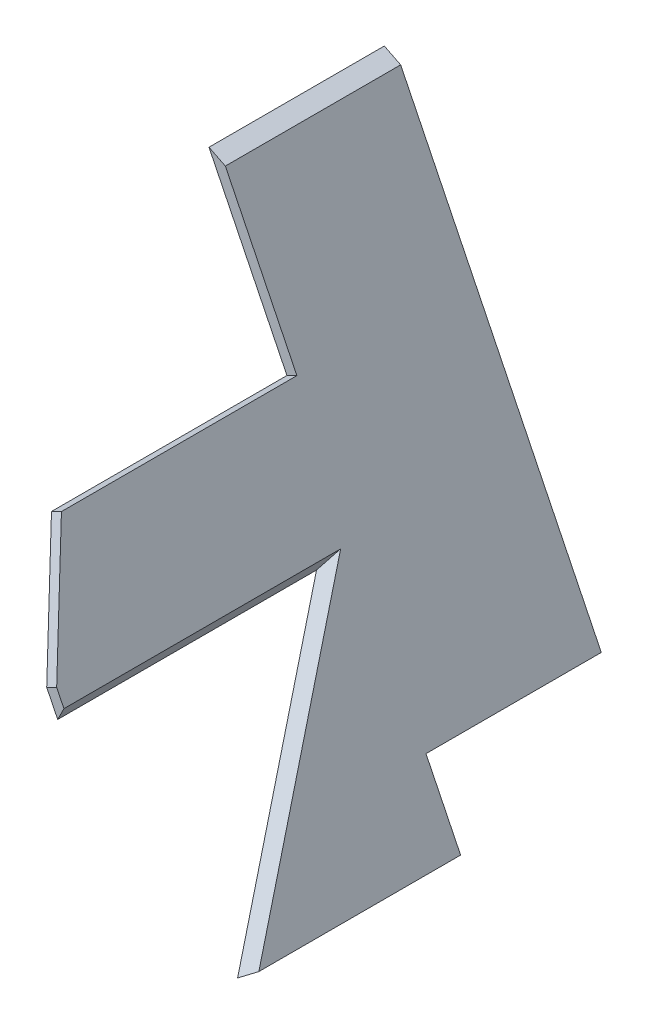
ISO-10303-21;
HEADER;
FILE_DESCRIPTION(('STEP AP214'),'2;1');
FILE_NAME('part.step','',(''),(''),'','','');
FILE_SCHEMA(('AUTOMOTIVE_DESIGN { 1 0 10303 214 1 1 1 1 }'));
ENDSEC;
DATA;
#1=APPLICATION_CONTEXT('core data for automotive mechanical design processes');
#2=APPLICATION_PROTOCOL_DEFINITION('international standard','automotive_design',2000,#1);
#3=PRODUCT_CONTEXT('',#1,'mechanical');
#4=PRODUCT('Part','Part','',(#3));
#5=PRODUCT_RELATED_PRODUCT_CATEGORY('part','',(#4));
#6=PRODUCT_DEFINITION_FORMATION('','',#4);
#7=PRODUCT_DEFINITION_CONTEXT('part definition',#1,'design');
#8=PRODUCT_DEFINITION('design','',#6,#7);
#9=PRODUCT_DEFINITION_SHAPE('','',#8);
#10=(LENGTH_UNIT() NAMED_UNIT(*) SI_UNIT(.MILLI.,.METRE.));
#11=(NAMED_UNIT(*) PLANE_ANGLE_UNIT() SI_UNIT($,.RADIAN.));
#12=(NAMED_UNIT(*) SI_UNIT($,.STERADIAN.) SOLID_ANGLE_UNIT());
#13=UNCERTAINTY_MEASURE_WITH_UNIT(LENGTH_MEASURE(1.E-05),#10,'distance_accuracy_value','');
#14=(GEOMETRIC_REPRESENTATION_CONTEXT(3) GLOBAL_UNCERTAINTY_ASSIGNED_CONTEXT((#13)) GLOBAL_UNIT_ASSIGNED_CONTEXT((#10,
#11,#12)) REPRESENTATION_CONTEXT('',''));
#15=CARTESIAN_POINT('',(0.,0.,0.));
#16=DIRECTION('',(0.,0.,1.));
#17=DIRECTION('',(1.,0.,0.));
#18=AXIS2_PLACEMENT_3D('',#15,#16,#17);
#19=CARTESIAN_POINT('',(-552.096326617514,302.49729542093,598.58590462317));
#20=DIRECTION('',(-0.440786583584168,0.897611936045971,0.));
#21=DIRECTION('',(-0.897611936045971,-0.440786583584168,0.));
#22=AXIS2_PLACEMENT_3D('',#19,#20,#21);
#23=PLANE('',#22);
#24=DIRECTION('',(0.629407485757153,0.309080532675746,-0.712962440240533));
#25=VECTOR('',#24,1.);
#26=CARTESIAN_POINT('',(-717.79653583628,221.127578522489,417.029710060112));
#27=LINE('',#26,#25);
#28=CARTESIAN_POINT('',(-552.096326617514,302.49729542093,229.332505647517));
#29=VERTEX_POINT('',#28);
#30=CARTESIAN_POINT('',(-547.608266937284,304.701228338851,224.248648124416));
#31=VERTEX_POINT('',#30);
#32=EDGE_CURVE('E182',#29,#31,#27,.T.);
#33=ORIENTED_EDGE('',*,*,#32,.F.);
#34=DIRECTION('',(0.,0.,-1.));
#35=VECTOR('',#34,1.);
#36=CARTESIAN_POINT('',(-552.096326617514,302.49729542093,598.58590462317));
#37=LINE('',#36,#35);
#38=CARTESIAN_POINT('',(-552.096326617514,302.49729542093,133.323635178291));
#39=VERTEX_POINT('',#38);
#40=EDGE_CURVE('E194',#29,#39,#37,.T.);
#41=ORIENTED_EDGE('',*,*,#40,.T.);
#42=DIRECTION('',(0.897611936045971,0.440786583584168,0.));
#43=VECTOR('',#42,1.);
#44=CARTESIAN_POINT('',(-552.096326617514,302.49729542093,133.323635178291));
#45=LINE('',#44,#43);
#46=CARTESIAN_POINT('',(-547.608266937284,304.701228338851,133.323635178291));
#47=VERTEX_POINT('',#46);
#48=EDGE_CURVE('E191',#39,#47,#45,.T.);
#49=ORIENTED_EDGE('',*,*,#48,.T.);
#50=DIRECTION('',(0.,0.,-1.));
#51=VECTOR('',#50,1.);
#52=CARTESIAN_POINT('',(-547.608266937284,304.701228338851,598.58590462317));
#53=LINE('',#52,#51);
#54=EDGE_CURVE('E190',#31,#47,#53,.T.);
#55=ORIENTED_EDGE('',*,*,#54,.F.);
#56=EDGE_LOOP('',(#33,#41,#49,#55));
#57=FACE_BOUND('',#56,.T.);
#58=ADVANCED_FACE('F33',(#57),#23,.F.);
#59=CARTESIAN_POINT('',(-552.096326617514,302.49729542093,598.58590462317));
#60=DIRECTION('',(0.897611936045971,0.44078658358417,0.));
#61=DIRECTION('',(-0.44078658358417,0.897611936045971,0.));
#62=AXIS2_PLACEMENT_3D('',#59,#60,#61);
#63=PLANE('',#62);
#64=DIRECTION('',(0.,0.,1.));
#65=VECTOR('',#64,1.);
#66=CARTESIAN_POINT('',(-598.671203575544,397.341755380355,598.58590462317));
#67=LINE('',#66,#65);
#68=CARTESIAN_POINT('',(-598.671203575544,397.341755380355,147.184878783266));
#69=VERTEX_POINT('',#68);
#70=CARTESIAN_POINT('',(-598.671203575544,397.341755380355,263.823635178291));
#71=VERTEX_POINT('',#70);
#72=EDGE_CURVE('E180',#69,#71,#67,.T.);
#73=ORIENTED_EDGE('',*,*,#72,.T.);
#74=DIRECTION('',(0.440786583584166,-0.897611936045972,0.));
#75=VECTOR('',#74,1.);
#76=CARTESIAN_POINT('',(-598.671203575545,397.341755380355,263.823635178291));
#77=LINE('',#76,#75);
#78=CARTESIAN_POINT('',(-603.624347029621,407.42827083002,263.823635178291));
#79=VERTEX_POINT('',#78);
#80=EDGE_CURVE('E56',#79,#71,#77,.T.);
#81=ORIENTED_EDGE('',*,*,#80,.F.);
#82=DIRECTION('',(0.396859477335349,-0.808159361141603,0.435179275986702));
#83=VECTOR('',#82,1.);
#84=CARTESIAN_POINT('',(-603.624347029621,407.42827083002,263.823635178291));
#85=LINE('',#84,#83);
#86=CARTESIAN_POINT('',(-625.869704104738,452.728420099233,239.430319813834));
#87=VERTEX_POINT('',#86);
#88=EDGE_CURVE('E160',#87,#79,#85,.T.);
#89=ORIENTED_EDGE('',*,*,#88,.F.);
#90=DIRECTION('',(0.,0.,1.));
#91=VECTOR('',#90,1.);
#92=CARTESIAN_POINT('',(-625.869704104738,452.728420099233,239.430319813834));
#93=LINE('',#92,#91);
#94=CARTESIAN_POINT('',(-625.869704104738,452.728420099233,133.323635178291));
#95=VERTEX_POINT('',#94);
#96=EDGE_CURVE('E126',#95,#87,#93,.T.);
#97=ORIENTED_EDGE('',*,*,#96,.F.);
#98=DIRECTION('',(-0.440786583584173,0.897611936045969,0.));
#99=VECTOR('',#98,1.);
#100=CARTESIAN_POINT('',(-567.701533333508,334.275530817394,133.323635178291));
#101=LINE('',#100,#99);
#102=CARTESIAN_POINT('',(-660.996902766903,524.260980238956,133.323635178291));
#103=VERTEX_POINT('',#102);
#104=EDGE_CURVE('E118',#95,#103,#101,.T.);
#105=ORIENTED_EDGE('',*,*,#104,.T.);
#106=DIRECTION('',(0.,0.,1.));
#107=VECTOR('',#106,1.);
#108=CARTESIAN_POINT('',(-660.996902766903,524.260980238956,-159.349175448453));
#109=LINE('',#108,#107);
#110=CARTESIAN_POINT('',(-660.996902766903,524.260980238956,54.323635178291));
#111=VERTEX_POINT('',#110);
#112=EDGE_CURVE('E122',#111,#103,#109,.T.);
#113=ORIENTED_EDGE('',*,*,#112,.F.);
#114=DIRECTION('',(0.440786583584174,-0.897611936045969,0.));
#115=VECTOR('',#114,1.);
#116=CARTESIAN_POINT('',(-567.701533333508,334.275530817394,54.323635178291));
#117=LINE('',#116,#115);
#118=CARTESIAN_POINT('',(-567.701533333508,334.275530817394,54.323635178291));
#119=VERTEX_POINT('',#118);
#120=EDGE_CURVE('E161',#111,#119,#117,.T.);
#121=ORIENTED_EDGE('',*,*,#120,.T.);
#122=DIRECTION('',(0.,0.,1.));
#123=VECTOR('',#122,1.);
#124=CARTESIAN_POINT('',(-567.701533333508,334.275530817394,-159.349175448453));
#125=LINE('',#124,#123);
#126=CARTESIAN_POINT('',(-567.701533333508,334.275530817394,133.323635178291));
#127=VERTEX_POINT('',#126);
#128=EDGE_CURVE('E149',#119,#127,#125,.T.);
#129=ORIENTED_EDGE('',*,*,#128,.T.);
#130=DIRECTION('',(0.44078658358417,-0.897611936045971,0.));
#131=VECTOR('',#130,1.);
#132=CARTESIAN_POINT('',(-552.096326617514,302.49729542093,133.323635178291));
#133=LINE('',#132,#131);
#134=EDGE_CURVE('E186',#127,#39,#133,.T.);
#135=ORIENTED_EDGE('',*,*,#134,.T.);
#136=ORIENTED_EDGE('',*,*,#40,.F.);
#137=DIRECTION('',(0.347991376961665,-0.708645011519996,0.613778664673308));
#138=VECTOR('',#137,1.);
#139=CARTESIAN_POINT('',(-473.227610305722,141.890090531788,368.439215144177));
#140=LINE('',#139,#138);
#141=EDGE_CURVE('E184',#69,#29,#140,.T.);
#142=ORIENTED_EDGE('',*,*,#141,.F.);
#143=EDGE_LOOP('',(#73,#81,#89,#97,#105,#113,#121,#129,#135,#136,#142));
#144=FACE_BOUND('',#143,.T.);
#145=ADVANCED_FACE('F35',(#144),#63,.F.);
#146=CARTESIAN_POINT('',(-547.608266937284,304.701228338851,598.58590462317));
#147=DIRECTION('',(-0.89761193604597,-0.440786583584171,0.));
#148=DIRECTION('',(0.440786583584171,-0.89761193604597,0.));
#149=AXIS2_PLACEMENT_3D('',#146,#147,#148);
#150=PLANE('',#149);
#151=DIRECTION('',(0.396859477335348,-0.808159361141603,0.435179275986702));
#152=VECTOR('',#151,1.);
#153=CARTESIAN_POINT('',(-499.551570641969,206.839211190197,373.024013123295));
#154=LINE('',#153,#152);
#155=CARTESIAN_POINT('',(-621.381644424507,454.932353017154,239.430319813834));
#156=VERTEX_POINT('',#155);
#157=CARTESIAN_POINT('',(-599.136287349391,409.632203747942,263.823635178291));
#158=VERTEX_POINT('',#157);
#159=EDGE_CURVE('E11',#156,#158,#154,.T.);
#160=ORIENTED_EDGE('',*,*,#159,.T.);
#161=DIRECTION('',(0.440786583584171,-0.89761193604597,0.));
#162=VECTOR('',#161,1.);
#163=CARTESIAN_POINT('',(-547.608266937284,304.701228338851,263.823635178291));
#164=LINE('',#163,#162);
#165=CARTESIAN_POINT('',(-595.86832537622,402.977369451919,263.823635178291));
#166=VERTEX_POINT('',#165);
#167=EDGE_CURVE('E168',#158,#166,#164,.T.);
#168=ORIENTED_EDGE('',*,*,#167,.T.);
#169=DIRECTION('',(0.,0.,-1.));
#170=VECTOR('',#169,1.);
#171=CARTESIAN_POINT('',(-595.86832537622,402.977369451918,598.58590462317));
#172=LINE('',#171,#170);
#173=CARTESIAN_POINT('',(-595.86832537622,402.977369451919,139.128739452171));
#174=VERTEX_POINT('',#173);
#175=EDGE_CURVE('E178',#166,#174,#172,.T.);
#176=ORIENTED_EDGE('',*,*,#175,.T.);
#177=DIRECTION('',(-0.347991376961666,0.708645011519996,-0.613778664673308));
#178=VECTOR('',#177,1.);
#179=CARTESIAN_POINT('',(-467.653691110397,141.882793575848,365.270570029548));
#180=LINE('',#179,#178);
#181=EDGE_CURVE('E189',#31,#174,#180,.T.);
#182=ORIENTED_EDGE('',*,*,#181,.F.);
#183=ORIENTED_EDGE('',*,*,#54,.T.);
#184=DIRECTION('',(-0.440786583584171,0.89761193604597,0.));
#185=VECTOR('',#184,1.);
#186=CARTESIAN_POINT('',(-547.608266937284,304.701228338851,133.323635178291));
#187=LINE('',#186,#185);
#188=CARTESIAN_POINT('',(-563.213473653278,336.479463735315,133.323635178291));
#189=VERTEX_POINT('',#188);
#190=EDGE_CURVE('E187',#47,#189,#187,.T.);
#191=ORIENTED_EDGE('',*,*,#190,.T.);
#192=DIRECTION('',(0.,0.,1.));
#193=VECTOR('',#192,1.);
#194=CARTESIAN_POINT('',(-563.213473653278,336.479463735315,-159.349175448453));
#195=LINE('',#194,#193);
#196=CARTESIAN_POINT('',(-563.213473653278,336.479463735315,54.323635178291));
#197=VERTEX_POINT('',#196);
#198=EDGE_CURVE('E152',#197,#189,#195,.T.);
#199=ORIENTED_EDGE('',*,*,#198,.F.);
#200=DIRECTION('',(-0.440786583584174,0.897611936045969,0.));
#201=VECTOR('',#200,1.);
#202=CARTESIAN_POINT('',(-563.213473653278,336.479463735315,54.323635178291));
#203=LINE('',#202,#201);
#204=CARTESIAN_POINT('',(-653.626470854523,520.59528868086,54.323635178291));
#205=VERTEX_POINT('',#204);
#206=EDGE_CURVE('E158',#197,#205,#203,.T.);
#207=ORIENTED_EDGE('',*,*,#206,.T.);
#208=DIRECTION('',(0.,0.,1.));
#209=VECTOR('',#208,1.);
#210=CARTESIAN_POINT('',(-653.626470854523,520.59528868086,-159.349175448453));
#211=LINE('',#210,#209);
#212=CARTESIAN_POINT('',(-653.626470854523,520.59528868086,133.323635178291));
#213=VERTEX_POINT('',#212);
#214=EDGE_CURVE('E139',#205,#213,#211,.T.);
#215=ORIENTED_EDGE('',*,*,#214,.T.);
#216=DIRECTION('',(0.440786583584174,-0.897611936045969,0.));
#217=VECTOR('',#216,1.);
#218=CARTESIAN_POINT('',(-563.213473653278,336.479463735315,133.323635178291));
#219=LINE('',#218,#217);
#220=CARTESIAN_POINT('',(-621.381644424507,454.932353017154,133.323635178291));
#221=VERTEX_POINT('',#220);
#222=EDGE_CURVE('E143',#213,#221,#219,.T.);
#223=ORIENTED_EDGE('',*,*,#222,.T.);
#224=DIRECTION('',(0.,0.,1.));
#225=VECTOR('',#224,1.);
#226=CARTESIAN_POINT('',(-621.381644424507,454.932353017154,598.58590462317));
#227=LINE('',#226,#225);
#228=EDGE_CURVE('E172',#221,#156,#227,.T.);
#229=ORIENTED_EDGE('',*,*,#228,.T.);
#230=EDGE_LOOP('',(#160,#168,#176,#182,#183,#191,#199,#207,#215,#223,#229));
#231=FACE_BOUND('',#230,.T.);
#232=ADVANCED_FACE('F206',(#231),#150,.F.);
#233=CARTESIAN_POINT('',(0.,0.,133.323635178291));
#234=DIRECTION('',(0.,0.,-1.));
#235=DIRECTION('',(-1.,0.,0.));
#236=AXIS2_PLACEMENT_3D('',#233,#234,#235);
#237=PLANE('',#236);
#238=DIRECTION('',(-0.897611936045971,-0.440786583584169,0.));
#239=VECTOR('',#238,1.);
#240=CARTESIAN_POINT('',(-567.701533333508,334.275530817394,133.323635178291));
#241=LINE('',#240,#239);
#242=EDGE_CURVE('E48',#189,#127,#241,.T.);
#243=ORIENTED_EDGE('',*,*,#242,.F.);
#244=ORIENTED_EDGE('',*,*,#190,.F.);
#245=ORIENTED_EDGE('',*,*,#48,.F.);
#246=ORIENTED_EDGE('',*,*,#134,.F.);
#247=EDGE_LOOP('',(#243,#244,#245,#246));
#248=FACE_BOUND('',#247,.T.);
#249=ADVANCED_FACE('F232',(#248),#237,.T.);
#250=CARTESIAN_POINT('',(56.4565287075856,113.514460846991,99.0504798395569));
#251=DIRECTION('',(0.350913088075688,0.705564279436691,0.61566147532566));
#252=DIRECTION('',(0.,-0.657471373061896,0.753479524342968));
#253=AXIS2_PLACEMENT_3D('',#250,#251,#252);
#254=PLANE('',#253);
#255=ORIENTED_EDGE('',*,*,#141,.T.);
#256=ORIENTED_EDGE('',*,*,#32,.T.);
#257=ORIENTED_EDGE('',*,*,#181,.T.);
#258=DIRECTION('',(0.274163351866622,0.551247230100458,-0.788010753606721));
#259=VECTOR('',#258,1.);
#260=CARTESIAN_POINT('',(-555.591835400887,483.959394897362,23.3645171299408));
#261=LINE('',#260,#259);
#262=EDGE_CURVE('E175',#69,#174,#261,.T.);
#263=ORIENTED_EDGE('',*,*,#262,.F.);
#264=EDGE_LOOP('',(#255,#256,#257,#263));
#265=FACE_BOUND('',#264,.T.);
#266=ADVANCED_FACE('F235',(#265),#254,.T.);
#267=CARTESIAN_POINT('',(-473.841316471693,648.331280534786,166.792182847926));
#268=DIRECTION('',(-0.895373922509721,0.445315100675417,0.));
#269=DIRECTION('',(-0.445315100675417,-0.895373922509721,0.));
#270=AXIS2_PLACEMENT_3D('',#267,#268,#269);
#271=PLANE('',#270);
#272=ORIENTED_EDGE('',*,*,#175,.F.);
#273=DIRECTION('',(-0.445315100675417,-0.895373922509721,0.));
#274=VECTOR('',#273,1.);
#275=CARTESIAN_POINT('',(-473.841316471693,648.331280534786,263.823635178291));
#276=LINE('',#275,#274);
#277=EDGE_CURVE('E201',#166,#71,#276,.T.);
#278=ORIENTED_EDGE('',*,*,#277,.T.);
#279=ORIENTED_EDGE('',*,*,#72,.F.);
#280=ORIENTED_EDGE('',*,*,#262,.T.);
#281=EDGE_LOOP('',(#272,#278,#279,#280));
#282=FACE_BOUND('',#281,.T.);
#283=ADVANCED_FACE('F236',(#282),#271,.F.);
#284=CARTESIAN_POINT('',(-509.018957914891,453.885748256432,263.823635178291));
#285=DIRECTION('',(0.191821186308811,-0.390622112445508,-0.900343821965636));
#286=DIRECTION('',(0.,0.917379661557827,-0.398013261789161));
#287=AXIS2_PLACEMENT_3D('',#284,#285,#286);
#288=PLANE('',#287);
#289=DIRECTION('',(-0.89761193604597,-0.440786583584171,0.));
#290=VECTOR('',#289,1.);
#291=CARTESIAN_POINT('',(-531.264314990007,499.185897525645,239.430319813834));
#292=LINE('',#291,#290);
#293=EDGE_CURVE('E165',#156,#87,#292,.T.);
#294=ORIENTED_EDGE('',*,*,#293,.T.);
#295=ORIENTED_EDGE('',*,*,#88,.T.);
#296=DIRECTION('',(-0.89761193604597,-0.440786583584171,0.));
#297=VECTOR('',#296,1.);
#298=CARTESIAN_POINT('',(-509.018957914891,453.885748256432,263.823635178291));
#299=LINE('',#298,#297);
#300=EDGE_CURVE('E166',#158,#79,#299,.T.);
#301=ORIENTED_EDGE('',*,*,#300,.F.);
#302=ORIENTED_EDGE('',*,*,#159,.F.);
#303=EDGE_LOOP('',(#294,#295,#301,#302));
#304=FACE_BOUND('',#303,.T.);
#305=ADVANCED_FACE('F239',(#304),#288,.F.);
#306=CARTESIAN_POINT('',(-531.264314990007,499.185897525645,239.430319813834));
#307=DIRECTION('',(0.440786583584171,-0.89761193604597,0.));
#308=DIRECTION('',(0.89761193604597,0.440786583584171,0.));
#309=AXIS2_PLACEMENT_3D('',#306,#307,#308);
#310=PLANE('',#309);
#311=DIRECTION('',(-0.89761193604597,-0.440786583584171,0.));
#312=VECTOR('',#311,1.);
#313=CARTESIAN_POINT('',(-300.726383196333,612.395206873209,133.323635178291));
#314=LINE('',#313,#312);
#315=EDGE_CURVE('E41',#221,#95,#314,.T.);
#316=ORIENTED_EDGE('',*,*,#315,.T.);
#317=ORIENTED_EDGE('',*,*,#96,.T.);
#318=ORIENTED_EDGE('',*,*,#293,.F.);
#319=ORIENTED_EDGE('',*,*,#228,.F.);
#320=EDGE_LOOP('',(#316,#317,#318,#319));
#321=FACE_BOUND('',#320,.T.);
#322=ADVANCED_FACE('F203',(#321),#310,.F.);
#323=CARTESIAN_POINT('',(-504.065814460814,443.799232806766,263.823635178291));
#324=DIRECTION('',(0.,0.,-1.));
#325=DIRECTION('',(-1.,0.,0.));
#326=AXIS2_PLACEMENT_3D('',#323,#324,#325);
#327=PLANE('',#326);
#328=ORIENTED_EDGE('',*,*,#300,.T.);
#329=ORIENTED_EDGE('',*,*,#80,.T.);
#330=ORIENTED_EDGE('',*,*,#277,.F.);
#331=ORIENTED_EDGE('',*,*,#167,.F.);
#332=EDGE_LOOP('',(#328,#329,#330,#331));
#333=FACE_BOUND('',#332,.T.);
#334=ADVANCED_FACE('F246',(#333),#327,.F.);
#335=CARTESIAN_POINT('',(0.,0.,133.323635178291));
#336=DIRECTION('',(0.,0.,-1.));
#337=DIRECTION('',(-1.,0.,0.));
#338=AXIS2_PLACEMENT_3D('',#335,#336,#337);
#339=PLANE('',#338);
#340=ORIENTED_EDGE('',*,*,#315,.F.);
#341=ORIENTED_EDGE('',*,*,#222,.F.);
#342=DIRECTION('',(0.895373922509719,-0.445315100675421,0.));
#343=VECTOR('',#342,1.);
#344=CARTESIAN_POINT('',(-660.996902766903,524.260980238956,133.323635178291));
#345=LINE('',#344,#343);
#346=EDGE_CURVE('E130',#103,#213,#345,.T.);
#347=ORIENTED_EDGE('',*,*,#346,.F.);
#348=ORIENTED_EDGE('',*,*,#104,.F.);
#349=EDGE_LOOP('',(#340,#341,#347,#348));
#350=FACE_BOUND('',#349,.T.);
#351=ADVANCED_FACE('F141',(#350),#339,.F.);
#352=CARTESIAN_POINT('',(-567.701533333508,334.275530817394,-159.349175448453));
#353=DIRECTION('',(-0.440786583584168,0.897611936045971,0.));
#354=DIRECTION('',(-0.897611936045971,-0.440786583584169,0.));
#355=AXIS2_PLACEMENT_3D('',#352,#353,#354);
#356=PLANE('',#355);
#357=ORIENTED_EDGE('',*,*,#128,.F.);
#358=DIRECTION('',(0.897611936045971,0.440786583584169,0.));
#359=VECTOR('',#358,1.);
#360=CARTESIAN_POINT('',(-567.701533333508,334.275530817394,54.323635178291));
#361=LINE('',#360,#359);
#362=EDGE_CURVE('E138',#119,#197,#361,.T.);
#363=ORIENTED_EDGE('',*,*,#362,.T.);
#364=ORIENTED_EDGE('',*,*,#198,.T.);
#365=ORIENTED_EDGE('',*,*,#242,.T.);
#366=EDGE_LOOP('',(#357,#363,#364,#365));
#367=FACE_BOUND('',#366,.T.);
#368=ADVANCED_FACE('F214',(#367),#356,.F.);
#369=CARTESIAN_POINT('',(-660.996902766903,524.260980238956,-159.349175448453));
#370=DIRECTION('',(-0.445315100675421,-0.895373922509719,0.));
#371=DIRECTION('',(0.895373922509719,-0.445315100675421,0.));
#372=AXIS2_PLACEMENT_3D('',#369,#370,#371);
#373=PLANE('',#372);
#374=ORIENTED_EDGE('',*,*,#214,.F.);
#375=DIRECTION('',(-0.895373922509719,0.445315100675421,0.));
#376=VECTOR('',#375,1.);
#377=CARTESIAN_POINT('',(-660.996902766903,524.260980238956,54.323635178291));
#378=LINE('',#377,#376);
#379=EDGE_CURVE('E137',#205,#111,#378,.T.);
#380=ORIENTED_EDGE('',*,*,#379,.T.);
#381=ORIENTED_EDGE('',*,*,#112,.T.);
#382=ORIENTED_EDGE('',*,*,#346,.T.);
#383=EDGE_LOOP('',(#374,#380,#381,#382));
#384=FACE_BOUND('',#383,.T.);
#385=ADVANCED_FACE('F135',(#384),#373,.F.);
#386=CARTESIAN_POINT('',(-565.874147388555,160.129114275513,54.323635178291));
#387=DIRECTION('',(0.,0.,1.));
#388=DIRECTION('',(-0.895373922509721,0.445315100675417,0.));
#389=AXIS2_PLACEMENT_3D('',#386,#387,#388);
#390=PLANE('',#389);
#391=ORIENTED_EDGE('',*,*,#379,.F.);
#392=ORIENTED_EDGE('',*,*,#206,.F.);
#393=ORIENTED_EDGE('',*,*,#362,.F.);
#394=ORIENTED_EDGE('',*,*,#120,.F.);
#395=EDGE_LOOP('',(#391,#392,#393,#394));
#396=FACE_BOUND('',#395,.T.);
#397=ADVANCED_FACE('F215',(#396),#390,.F.);
#398=CLOSED_SHELL('',(#58,#145,#232,#249,#266,#283,#305,#322,#334,#351,#368,#385,#397));
#399=MANIFOLD_SOLID_BREP('B2',#398);
#400=ADVANCED_BREP_SHAPE_REPRESENTATION('',(#18,#399),#14);
#401=SHAPE_DEFINITION_REPRESENTATION(#9,#400);
ENDSEC;
END-ISO-10303-21;
